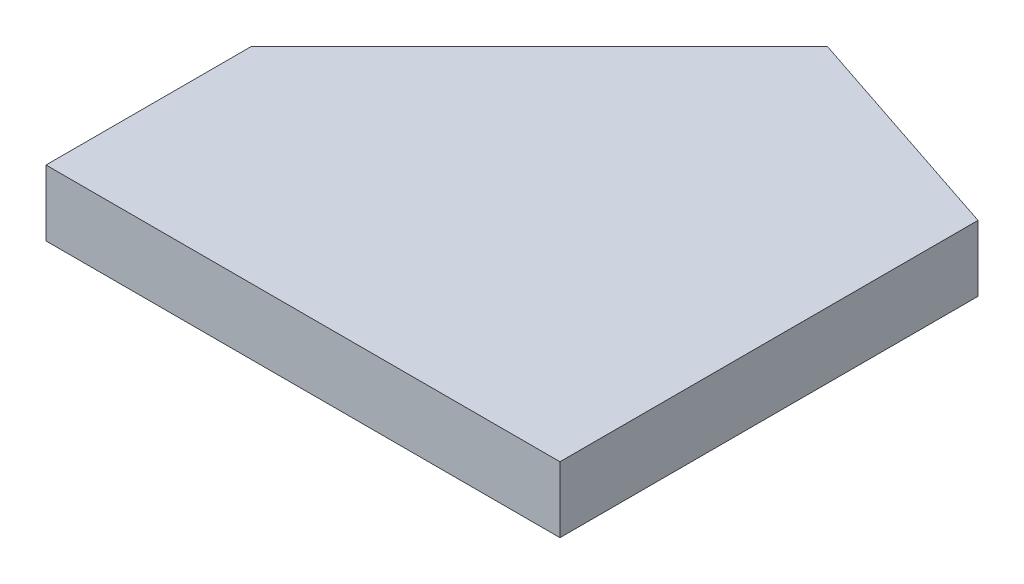
ISO-10303-21;
HEADER;
FILE_DESCRIPTION(('STEP AP214'),'2;1');
FILE_NAME('part.step','',(''),(''),'','','');
FILE_SCHEMA(('AUTOMOTIVE_DESIGN { 1 0 10303 214 1 1 1 1 }'));
ENDSEC;
DATA;
#1=APPLICATION_CONTEXT('core data for automotive mechanical design processes');
#2=APPLICATION_PROTOCOL_DEFINITION('international standard','automotive_design',2000,#1);
#3=PRODUCT_CONTEXT('',#1,'mechanical');
#4=PRODUCT('Part','Part','',(#3));
#5=PRODUCT_RELATED_PRODUCT_CATEGORY('part','',(#4));
#6=PRODUCT_DEFINITION_FORMATION('','',#4);
#7=PRODUCT_DEFINITION_CONTEXT('part definition',#1,'design');
#8=PRODUCT_DEFINITION('design','',#6,#7);
#9=PRODUCT_DEFINITION_SHAPE('','',#8);
#10=(LENGTH_UNIT() NAMED_UNIT(*) SI_UNIT(.MILLI.,.METRE.));
#11=(NAMED_UNIT(*) PLANE_ANGLE_UNIT() SI_UNIT($,.RADIAN.));
#12=(NAMED_UNIT(*) SI_UNIT($,.STERADIAN.) SOLID_ANGLE_UNIT());
#13=UNCERTAINTY_MEASURE_WITH_UNIT(LENGTH_MEASURE(1.E-05),#10,'distance_accuracy_value','');
#14=(GEOMETRIC_REPRESENTATION_CONTEXT(3) GLOBAL_UNCERTAINTY_ASSIGNED_CONTEXT((#13)) GLOBAL_UNIT_ASSIGNED_CONTEXT((#10,
#11,#12)) REPRESENTATION_CONTEXT('',''));
#15=CARTESIAN_POINT('',(0.,0.,0.));
#16=DIRECTION('',(0.,0.,1.));
#17=DIRECTION('',(1.,0.,0.));
#18=AXIS2_PLACEMENT_3D('',#15,#16,#17);
#19=CARTESIAN_POINT('',(50.,6.4,0.));
#20=DIRECTION('',(1.,0.,0.));
#21=DIRECTION('',(0.,0.,-1.));
#22=AXIS2_PLACEMENT_3D('',#19,#20,#21);
#23=PLANE('',#22);
#24=DIRECTION('',(0.,0.,1.));
#25=VECTOR('',#24,1.);
#26=CARTESIAN_POINT('',(50.,0.,0.));
#27=LINE('',#26,#25);
#28=CARTESIAN_POINT('',(50.,0.,-40.6666666666668));
#29=VERTEX_POINT('',#28);
#30=CARTESIAN_POINT('',(50.,0.,0.));
#31=VERTEX_POINT('',#30);
#32=EDGE_CURVE('E110',#29,#31,#27,.T.);
#33=ORIENTED_EDGE('',*,*,#32,.F.);
#34=DIRECTION('',(0.,-1.,0.));
#35=VECTOR('',#34,1.);
#36=CARTESIAN_POINT('',(50.,6.4,-40.6666666666668));
#37=LINE('',#36,#35);
#38=CARTESIAN_POINT('',(50.,6.4,-40.6666666666668));
#39=VERTEX_POINT('',#38);
#40=EDGE_CURVE('E11',#39,#29,#37,.T.);
#41=ORIENTED_EDGE('',*,*,#40,.F.);
#42=DIRECTION('',(0.,0.,1.));
#43=VECTOR('',#42,1.);
#44=CARTESIAN_POINT('',(50.,6.4,0.));
#45=LINE('',#44,#43);
#46=CARTESIAN_POINT('',(50.,6.4,0.));
#47=VERTEX_POINT('',#46);
#48=EDGE_CURVE('E121',#39,#47,#45,.T.);
#49=ORIENTED_EDGE('',*,*,#48,.T.);
#50=DIRECTION('',(0.,-1.,0.));
#51=VECTOR('',#50,1.);
#52=CARTESIAN_POINT('',(50.,6.4,0.));
#53=LINE('',#52,#51);
#54=EDGE_CURVE('E78',#47,#31,#53,.T.);
#55=ORIENTED_EDGE('',*,*,#54,.T.);
#56=EDGE_LOOP('',(#33,#41,#49,#55));
#57=FACE_BOUND('',#56,.T.);
#58=ADVANCED_FACE('F37',(#57),#23,.T.);
#59=CARTESIAN_POINT('',(17.2000000000003,6.4,-51.6000000000001));
#60=DIRECTION('',(0.316227766016841,0.,-0.948683298050513));
#61=DIRECTION('',(-0.948683298050513,0.,-0.316227766016841));
#62=AXIS2_PLACEMENT_3D('',#59,#60,#61);
#63=PLANE('',#62);
#64=DIRECTION('',(0.948683298050513,0.,0.316227766016841));
#65=VECTOR('',#64,1.);
#66=CARTESIAN_POINT('',(17.2000000000003,0.,-51.6000000000001));
#67=LINE('',#66,#65);
#68=CARTESIAN_POINT('',(28.0000000000001,0.,-48.0000000000001));
#69=VERTEX_POINT('',#68);
#70=EDGE_CURVE('E113',#69,#29,#67,.T.);
#71=ORIENTED_EDGE('',*,*,#70,.F.);
#72=DIRECTION('',(0.,-1.,0.));
#73=VECTOR('',#72,1.);
#74=CARTESIAN_POINT('',(28.0000000000001,6.4,-48.0000000000001));
#75=LINE('',#74,#73);
#76=CARTESIAN_POINT('',(28.0000000000001,6.4,-48.0000000000001));
#77=VERTEX_POINT('',#76);
#78=EDGE_CURVE('E45',#77,#69,#75,.T.);
#79=ORIENTED_EDGE('',*,*,#78,.F.);
#80=DIRECTION('',(0.948683298050513,0.,0.316227766016841));
#81=VECTOR('',#80,1.);
#82=CARTESIAN_POINT('',(17.2000000000003,6.4,-51.6000000000001));
#83=LINE('',#82,#81);
#84=EDGE_CURVE('E103',#77,#39,#83,.T.);
#85=ORIENTED_EDGE('',*,*,#84,.T.);
#86=ORIENTED_EDGE('',*,*,#40,.T.);
#87=EDGE_LOOP('',(#71,#79,#85,#86));
#88=FACE_BOUND('',#87,.T.);
#89=ADVANCED_FACE('F125',(#88),#63,.T.);
#90=CARTESIAN_POINT('',(-10.,6.4,-10.));
#91=DIRECTION('',(-0.707106781186548,0.,-0.707106781186548));
#92=DIRECTION('',(-0.707106781186548,0.,0.707106781186548));
#93=AXIS2_PLACEMENT_3D('',#90,#91,#92);
#94=PLANE('',#93);
#95=DIRECTION('',(0.707106781186548,0.,-0.707106781186548));
#96=VECTOR('',#95,1.);
#97=CARTESIAN_POINT('',(-10.,0.,-10.));
#98=LINE('',#97,#96);
#99=CARTESIAN_POINT('',(0.,0.,-20.));
#100=VERTEX_POINT('',#99);
#101=EDGE_CURVE('E93',#100,#69,#98,.T.);
#102=ORIENTED_EDGE('',*,*,#101,.F.);
#103=DIRECTION('',(0.,-1.,0.));
#104=VECTOR('',#103,1.);
#105=CARTESIAN_POINT('',(0.,6.4,-20.));
#106=LINE('',#105,#104);
#107=CARTESIAN_POINT('',(0.,6.4,-20.));
#108=VERTEX_POINT('',#107);
#109=EDGE_CURVE('E88',#108,#100,#106,.T.);
#110=ORIENTED_EDGE('',*,*,#109,.F.);
#111=DIRECTION('',(0.707106781186548,0.,-0.707106781186548));
#112=VECTOR('',#111,1.);
#113=CARTESIAN_POINT('',(-10.,6.4,-10.));
#114=LINE('',#113,#112);
#115=EDGE_CURVE('E91',#108,#77,#114,.T.);
#116=ORIENTED_EDGE('',*,*,#115,.T.);
#117=ORIENTED_EDGE('',*,*,#78,.T.);
#118=EDGE_LOOP('',(#102,#110,#116,#117));
#119=FACE_BOUND('',#118,.T.);
#120=ADVANCED_FACE('F90',(#119),#94,.T.);
#121=CARTESIAN_POINT('',(0.,6.4,0.));
#122=DIRECTION('',(-1.,0.,0.));
#123=DIRECTION('',(0.,0.,1.));
#124=AXIS2_PLACEMENT_3D('',#121,#122,#123);
#125=PLANE('',#124);
#126=DIRECTION('',(0.,0.,-1.));
#127=VECTOR('',#126,1.);
#128=CARTESIAN_POINT('',(0.,0.,0.));
#129=LINE('',#128,#127);
#130=CARTESIAN_POINT('',(0.,0.,0.));
#131=VERTEX_POINT('',#130);
#132=EDGE_CURVE('E117',#131,#100,#129,.T.);
#133=ORIENTED_EDGE('',*,*,#132,.F.);
#134=DIRECTION('',(0.,-1.,0.));
#135=VECTOR('',#134,1.);
#136=CARTESIAN_POINT('',(0.,6.4,0.));
#137=LINE('',#136,#135);
#138=CARTESIAN_POINT('',(0.,6.4,0.));
#139=VERTEX_POINT('',#138);
#140=EDGE_CURVE('E71',#139,#131,#137,.T.);
#141=ORIENTED_EDGE('',*,*,#140,.F.);
#142=DIRECTION('',(0.,0.,-1.));
#143=VECTOR('',#142,1.);
#144=CARTESIAN_POINT('',(0.,6.4,0.));
#145=LINE('',#144,#143);
#146=EDGE_CURVE('E101',#139,#108,#145,.T.);
#147=ORIENTED_EDGE('',*,*,#146,.T.);
#148=ORIENTED_EDGE('',*,*,#109,.T.);
#149=EDGE_LOOP('',(#133,#141,#147,#148));
#150=FACE_BOUND('',#149,.T.);
#151=ADVANCED_FACE('F105',(#150),#125,.T.);
#152=CARTESIAN_POINT('',(0.,6.4,0.));
#153=DIRECTION('',(0.,0.,-1.));
#154=DIRECTION('',(-1.,0.,0.));
#155=AXIS2_PLACEMENT_3D('',#152,#153,#154);
#156=PLANE('',#155);
#157=DIRECTION('',(1.,0.,0.));
#158=VECTOR('',#157,1.);
#159=CARTESIAN_POINT('',(0.,0.,0.));
#160=LINE('',#159,#158);
#161=EDGE_CURVE('E119',#131,#31,#160,.T.);
#162=ORIENTED_EDGE('',*,*,#161,.T.);
#163=ORIENTED_EDGE('',*,*,#54,.F.);
#164=DIRECTION('',(1.,0.,0.));
#165=VECTOR('',#164,1.);
#166=CARTESIAN_POINT('',(0.,6.4,0.));
#167=LINE('',#166,#165);
#168=EDGE_CURVE('E53',#139,#47,#167,.T.);
#169=ORIENTED_EDGE('',*,*,#168,.F.);
#170=ORIENTED_EDGE('',*,*,#140,.T.);
#171=EDGE_LOOP('',(#162,#163,#169,#170));
#172=FACE_BOUND('',#171,.T.);
#173=ADVANCED_FACE('F128',(#172),#156,.F.);
#174=CARTESIAN_POINT('',(0.,6.4,0.));
#175=DIRECTION('',(0.,1.,0.));
#176=DIRECTION('',(0.,0.,1.));
#177=AXIS2_PLACEMENT_3D('',#174,#175,#176);
#178=PLANE('',#177);
#179=ORIENTED_EDGE('',*,*,#48,.F.);
#180=ORIENTED_EDGE('',*,*,#84,.F.);
#181=ORIENTED_EDGE('',*,*,#115,.F.);
#182=ORIENTED_EDGE('',*,*,#146,.F.);
#183=ORIENTED_EDGE('',*,*,#168,.T.);
#184=EDGE_LOOP('',(#179,#180,#181,#182,#183));
#185=FACE_BOUND('',#184,.T.);
#186=ADVANCED_FACE('F100',(#185),#178,.T.);
#187=CARTESIAN_POINT('',(0.,0.,0.));
#188=DIRECTION('',(0.,1.,0.));
#189=DIRECTION('',(0.,0.,1.));
#190=AXIS2_PLACEMENT_3D('',#187,#188,#189);
#191=PLANE('',#190);
#192=ORIENTED_EDGE('',*,*,#32,.T.);
#193=ORIENTED_EDGE('',*,*,#161,.F.);
#194=ORIENTED_EDGE('',*,*,#132,.T.);
#195=ORIENTED_EDGE('',*,*,#101,.T.);
#196=ORIENTED_EDGE('',*,*,#70,.T.);
#197=EDGE_LOOP('',(#192,#193,#194,#195,#196));
#198=FACE_BOUND('',#197,.T.);
#199=ADVANCED_FACE('F127',(#198),#191,.F.);
#200=CLOSED_SHELL('',(#58,#89,#120,#151,#173,#186,#199));
#201=MANIFOLD_SOLID_BREP('B2',#200);
#202=ADVANCED_BREP_SHAPE_REPRESENTATION('',(#18,#201),#14);
#203=SHAPE_DEFINITION_REPRESENTATION(#9,#202);
ENDSEC;
END-ISO-10303-21;
